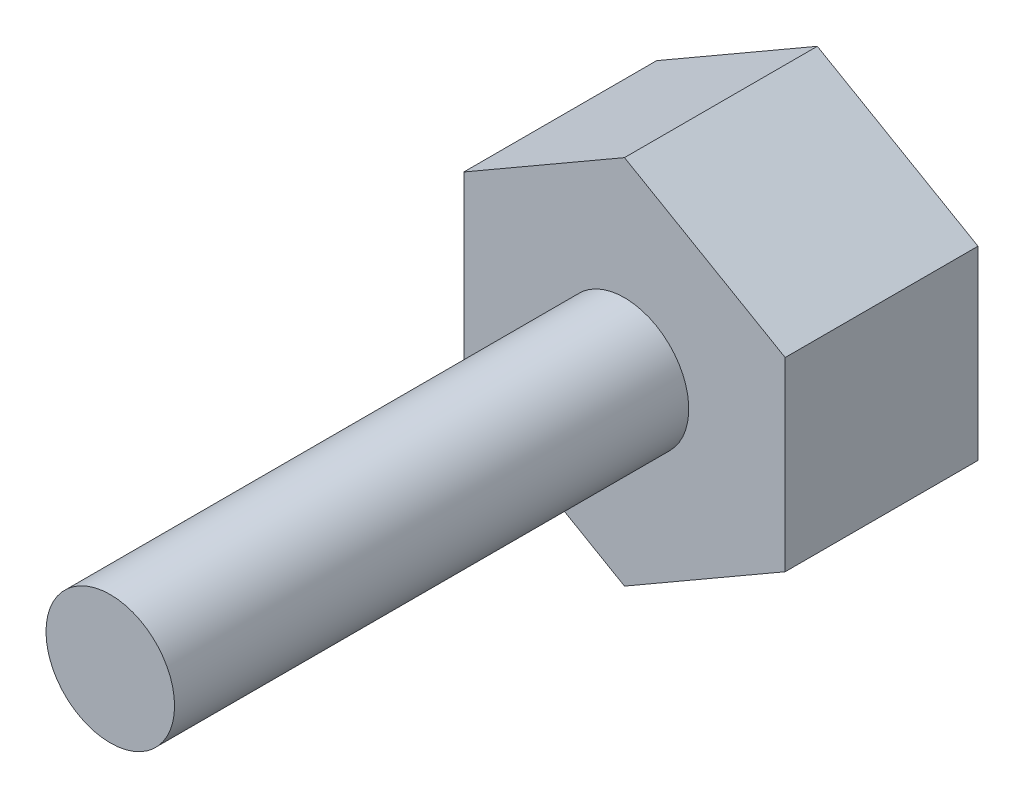
ISO-10303-21;
HEADER;
FILE_DESCRIPTION(('STEP AP214'),'2;1');
FILE_NAME('part.step','',(''),(''),'','','');
FILE_SCHEMA(('AUTOMOTIVE_DESIGN { 1 0 10303 214 1 1 1 1 }'));
ENDSEC;
DATA;
#1=APPLICATION_CONTEXT('core data for automotive mechanical design processes');
#2=APPLICATION_PROTOCOL_DEFINITION('international standard','automotive_design',2000,#1);
#3=PRODUCT_CONTEXT('',#1,'mechanical');
#4=PRODUCT('Part','Part','',(#3));
#5=PRODUCT_RELATED_PRODUCT_CATEGORY('part','',(#4));
#6=PRODUCT_DEFINITION_FORMATION('','',#4);
#7=PRODUCT_DEFINITION_CONTEXT('part definition',#1,'design');
#8=PRODUCT_DEFINITION('design','',#6,#7);
#9=PRODUCT_DEFINITION_SHAPE('','',#8);
#10=(LENGTH_UNIT() NAMED_UNIT(*) SI_UNIT(.MILLI.,.METRE.));
#11=(NAMED_UNIT(*) PLANE_ANGLE_UNIT() SI_UNIT($,.RADIAN.));
#12=(NAMED_UNIT(*) SI_UNIT($,.STERADIAN.) SOLID_ANGLE_UNIT());
#13=UNCERTAINTY_MEASURE_WITH_UNIT(LENGTH_MEASURE(1.E-05),#10,'distance_accuracy_value','');
#14=(GEOMETRIC_REPRESENTATION_CONTEXT(3) GLOBAL_UNCERTAINTY_ASSIGNED_CONTEXT((#13)) GLOBAL_UNIT_ASSIGNED_CONTEXT((#10,
#11,#12)) REPRESENTATION_CONTEXT('',''));
#15=CARTESIAN_POINT('',(0.,0.,0.));
#16=DIRECTION('',(0.,0.,1.));
#17=DIRECTION('',(1.,0.,0.));
#18=AXIS2_PLACEMENT_3D('',#15,#16,#17);
#19=CARTESIAN_POINT('',(-63.4947615904966,14.9787081339713,8.));
#20=DIRECTION('',(0.,0.,-1.));
#21=DIRECTION('',(-1.,0.,0.));
#22=AXIS2_PLACEMENT_3D('',#19,#20,#21);
#23=CYLINDRICAL_SURFACE('',#22,0.999999999999998);
#24=CARTESIAN_POINT('',(-63.4947615904966,14.9787081339713,8.));
#25=DIRECTION('',(0.,0.,1.));
#26=DIRECTION('',(1.,0.,0.));
#27=AXIS2_PLACEMENT_3D('',#24,#25,#26);
#28=CIRCLE('',#27,0.999999999999998);
#29=CARTESIAN_POINT('',(-62.4947615904966,14.9787081339713,8.));
#30=VERTEX_POINT('',#29);
#31=EDGE_CURVE('E11',#30,#30,#28,.T.);
#32=ORIENTED_EDGE('',*,*,#31,.F.);
#33=EDGE_LOOP('',(#32));
#34=FACE_BOUND('',#33,.T.);
#35=CARTESIAN_POINT('',(-63.4947615904966,14.9787081339713,0.));
#36=DIRECTION('',(0.,0.,-1.));
#37=DIRECTION('',(-1.,0.,0.));
#38=AXIS2_PLACEMENT_3D('',#35,#36,#37);
#39=CIRCLE('',#38,0.999999999999998);
#40=CARTESIAN_POINT('',(-64.4947615904966,14.9787081339713,0.));
#41=VERTEX_POINT('',#40);
#42=EDGE_CURVE('E41',#41,#41,#39,.T.);
#43=ORIENTED_EDGE('',*,*,#42,.F.);
#44=EDGE_LOOP('',(#43));
#45=FACE_BOUND('',#44,.T.);
#46=ADVANCED_FACE('F33',(#34,#45),#23,.T.);
#47=CARTESIAN_POINT('',(-63.4947615904966,14.9787081339713,8.));
#48=DIRECTION('',(0.,0.,1.));
#49=DIRECTION('',(1.,0.,0.));
#50=AXIS2_PLACEMENT_3D('',#47,#48,#49);
#51=PLANE('',#50);
#52=ORIENTED_EDGE('',*,*,#31,.T.);
#53=EDGE_LOOP('',(#52));
#54=FACE_BOUND('',#53,.T.);
#55=ADVANCED_FACE('F143',(#54),#51,.T.);
#56=CARTESIAN_POINT('',(-60.9947615904966,13.5353324609972,-3.));
#57=DIRECTION('',(-0.5,0.866025403784439,0.));
#58=DIRECTION('',(-0.866025403784439,-0.5,0.));
#59=AXIS2_PLACEMENT_3D('',#56,#57,#58);
#60=PLANE('',#59);
#61=DIRECTION('',(-0.866025403784439,-0.5,0.));
#62=VECTOR('',#61,1.);
#63=CARTESIAN_POINT('',(-60.9947615904966,13.5353324609972,0.));
#64=LINE('',#63,#62);
#65=CARTESIAN_POINT('',(-60.9947615904966,13.5353324609972,0.));
#66=VERTEX_POINT('',#65);
#67=CARTESIAN_POINT('',(-63.4947615904967,12.0919567880232,0.));
#68=VERTEX_POINT('',#67);
#69=EDGE_CURVE('E118',#66,#68,#64,.T.);
#70=ORIENTED_EDGE('',*,*,#69,.T.);
#71=DIRECTION('',(0.,0.,1.));
#72=VECTOR('',#71,1.);
#73=CARTESIAN_POINT('',(-63.4947615904967,12.0919567880232,-3.));
#74=LINE('',#73,#72);
#75=CARTESIAN_POINT('',(-63.4947615904967,12.0919567880232,-3.));
#76=VERTEX_POINT('',#75);
#77=EDGE_CURVE('E135',#76,#68,#74,.T.);
#78=ORIENTED_EDGE('',*,*,#77,.F.);
#79=DIRECTION('',(-0.866025403784439,-0.5,0.));
#80=VECTOR('',#79,1.);
#81=CARTESIAN_POINT('',(-60.9947615904966,13.5353324609972,-3.));
#82=LINE('',#81,#80);
#83=CARTESIAN_POINT('',(-60.9947615904966,13.5353324609972,-3.));
#84=VERTEX_POINT('',#83);
#85=EDGE_CURVE('E128',#84,#76,#82,.T.);
#86=ORIENTED_EDGE('',*,*,#85,.F.);
#87=DIRECTION('',(0.,0.,1.));
#88=VECTOR('',#87,1.);
#89=CARTESIAN_POINT('',(-60.9947615904966,13.5353324609972,-3.));
#90=LINE('',#89,#88);
#91=EDGE_CURVE('E114',#84,#66,#90,.T.);
#92=ORIENTED_EDGE('',*,*,#91,.T.);
#93=EDGE_LOOP('',(#70,#78,#86,#92));
#94=FACE_BOUND('',#93,.T.);
#95=ADVANCED_FACE('F148',(#94),#60,.F.);
#96=CARTESIAN_POINT('',(-63.4947615904967,12.0919567880232,-3.));
#97=DIRECTION('',(0.5,0.866025403784438,0.));
#98=DIRECTION('',(-0.866025403784438,0.5,0.));
#99=AXIS2_PLACEMENT_3D('',#96,#97,#98);
#100=PLANE('',#99);
#101=DIRECTION('',(-0.866025403784438,0.5,0.));
#102=VECTOR('',#101,1.);
#103=CARTESIAN_POINT('',(-63.4947615904967,12.0919567880232,0.));
#104=LINE('',#103,#102);
#105=CARTESIAN_POINT('',(-65.9947615904966,13.5353324609972,0.));
#106=VERTEX_POINT('',#105);
#107=EDGE_CURVE('E121',#68,#106,#104,.T.);
#108=ORIENTED_EDGE('',*,*,#107,.T.);
#109=DIRECTION('',(0.,0.,1.));
#110=VECTOR('',#109,1.);
#111=CARTESIAN_POINT('',(-65.9947615904966,13.5353324609972,-3.));
#112=LINE('',#111,#110);
#113=CARTESIAN_POINT('',(-65.9947615904966,13.5353324609972,-3.));
#114=VERTEX_POINT('',#113);
#115=EDGE_CURVE('E132',#114,#106,#112,.T.);
#116=ORIENTED_EDGE('',*,*,#115,.F.);
#117=DIRECTION('',(-0.866025403784438,0.5,0.));
#118=VECTOR('',#117,1.);
#119=CARTESIAN_POINT('',(-63.4947615904967,12.0919567880232,-3.));
#120=LINE('',#119,#118);
#121=EDGE_CURVE('E87',#76,#114,#120,.T.);
#122=ORIENTED_EDGE('',*,*,#121,.F.);
#123=ORIENTED_EDGE('',*,*,#77,.T.);
#124=EDGE_LOOP('',(#108,#116,#122,#123));
#125=FACE_BOUND('',#124,.T.);
#126=ADVANCED_FACE('F154',(#125),#100,.F.);
#127=CARTESIAN_POINT('',(-65.9947615904966,13.5353324609972,-3.));
#128=DIRECTION('',(1.,0.,0.));
#129=DIRECTION('',(0.,0.,-1.));
#130=AXIS2_PLACEMENT_3D('',#127,#128,#129);
#131=PLANE('',#130);
#132=DIRECTION('',(0.,1.,0.));
#133=VECTOR('',#132,1.);
#134=CARTESIAN_POINT('',(-65.9947615904966,13.5353324609972,0.));
#135=LINE('',#134,#133);
#136=CARTESIAN_POINT('',(-65.9947615904966,16.4220838069454,0.));
#137=VERTEX_POINT('',#136);
#138=EDGE_CURVE('E123',#106,#137,#135,.T.);
#139=ORIENTED_EDGE('',*,*,#138,.T.);
#140=DIRECTION('',(0.,0.,1.));
#141=VECTOR('',#140,1.);
#142=CARTESIAN_POINT('',(-65.9947615904966,16.4220838069454,-3.));
#143=LINE('',#142,#141);
#144=CARTESIAN_POINT('',(-65.9947615904966,16.4220838069454,-3.));
#145=VERTEX_POINT('',#144);
#146=EDGE_CURVE('E109',#145,#137,#143,.T.);
#147=ORIENTED_EDGE('',*,*,#146,.F.);
#148=DIRECTION('',(0.,1.,0.));
#149=VECTOR('',#148,1.);
#150=CARTESIAN_POINT('',(-65.9947615904966,13.5353324609972,-3.));
#151=LINE('',#150,#149);
#152=EDGE_CURVE('E100',#114,#145,#151,.T.);
#153=ORIENTED_EDGE('',*,*,#152,.F.);
#154=ORIENTED_EDGE('',*,*,#115,.T.);
#155=EDGE_LOOP('',(#139,#147,#153,#154));
#156=FACE_BOUND('',#155,.T.);
#157=ADVANCED_FACE('F160',(#156),#131,.F.);
#158=CARTESIAN_POINT('',(-65.9947615904966,16.4220838069454,-3.));
#159=DIRECTION('',(0.499999999999999,-0.866025403784439,0.));
#160=DIRECTION('',(0.866025403784439,0.499999999999999,0.));
#161=AXIS2_PLACEMENT_3D('',#158,#159,#160);
#162=PLANE('',#161);
#163=DIRECTION('',(0.866025403784439,0.499999999999999,0.));
#164=VECTOR('',#163,1.);
#165=CARTESIAN_POINT('',(-65.9947615904966,16.4220838069454,0.));
#166=LINE('',#165,#164);
#167=CARTESIAN_POINT('',(-63.4947615904966,17.8654594799194,0.));
#168=VERTEX_POINT('',#167);
#169=EDGE_CURVE('E108',#137,#168,#166,.T.);
#170=ORIENTED_EDGE('',*,*,#169,.T.);
#171=DIRECTION('',(0.,0.,1.));
#172=VECTOR('',#171,1.);
#173=CARTESIAN_POINT('',(-63.4947615904966,17.8654594799194,-3.));
#174=LINE('',#173,#172);
#175=CARTESIAN_POINT('',(-63.4947615904966,17.8654594799194,-3.));
#176=VERTEX_POINT('',#175);
#177=EDGE_CURVE('E105',#176,#168,#174,.T.);
#178=ORIENTED_EDGE('',*,*,#177,.F.);
#179=DIRECTION('',(0.866025403784439,0.499999999999999,0.));
#180=VECTOR('',#179,1.);
#181=CARTESIAN_POINT('',(-65.9947615904966,16.4220838069454,-3.));
#182=LINE('',#181,#180);
#183=EDGE_CURVE('E94',#145,#176,#182,.T.);
#184=ORIENTED_EDGE('',*,*,#183,.F.);
#185=ORIENTED_EDGE('',*,*,#146,.T.);
#186=EDGE_LOOP('',(#170,#178,#184,#185));
#187=FACE_BOUND('',#186,.T.);
#188=ADVANCED_FACE('F106',(#187),#162,.F.);
#189=CARTESIAN_POINT('',(-63.4947615904966,17.8654594799194,-3.));
#190=DIRECTION('',(-0.500000000000001,-0.866025403784438,0.));
#191=DIRECTION('',(0.866025403784438,-0.500000000000001,0.));
#192=AXIS2_PLACEMENT_3D('',#189,#190,#191);
#193=PLANE('',#192);
#194=DIRECTION('',(0.866025403784438,-0.500000000000001,0.));
#195=VECTOR('',#194,1.);
#196=CARTESIAN_POINT('',(-63.4947615904966,17.8654594799194,0.));
#197=LINE('',#196,#195);
#198=CARTESIAN_POINT('',(-60.9947615904966,16.4220838069454,0.));
#199=VERTEX_POINT('',#198);
#200=EDGE_CURVE('E72',#168,#199,#197,.T.);
#201=ORIENTED_EDGE('',*,*,#200,.T.);
#202=DIRECTION('',(0.,0.,1.));
#203=VECTOR('',#202,1.);
#204=CARTESIAN_POINT('',(-60.9947615904966,16.4220838069454,-3.));
#205=LINE('',#204,#203);
#206=CARTESIAN_POINT('',(-60.9947615904966,16.4220838069454,-3.));
#207=VERTEX_POINT('',#206);
#208=EDGE_CURVE('E110',#207,#199,#205,.T.);
#209=ORIENTED_EDGE('',*,*,#208,.F.);
#210=DIRECTION('',(0.866025403784438,-0.500000000000001,0.));
#211=VECTOR('',#210,1.);
#212=CARTESIAN_POINT('',(-63.4947615904966,17.8654594799194,-3.));
#213=LINE('',#212,#211);
#214=EDGE_CURVE('E98',#176,#207,#213,.T.);
#215=ORIENTED_EDGE('',*,*,#214,.F.);
#216=ORIENTED_EDGE('',*,*,#177,.T.);
#217=EDGE_LOOP('',(#201,#209,#215,#216));
#218=FACE_BOUND('',#217,.T.);
#219=ADVANCED_FACE('F112',(#218),#193,.F.);
#220=CARTESIAN_POINT('',(-60.9947615904966,16.4220838069454,-3.));
#221=DIRECTION('',(-1.,0.,0.));
#222=DIRECTION('',(0.,0.,1.));
#223=AXIS2_PLACEMENT_3D('',#220,#221,#222);
#224=PLANE('',#223);
#225=DIRECTION('',(0.,-1.,0.));
#226=VECTOR('',#225,1.);
#227=CARTESIAN_POINT('',(-60.9947615904966,16.4220838069454,0.));
#228=LINE('',#227,#226);
#229=EDGE_CURVE('E78',#199,#66,#228,.T.);
#230=ORIENTED_EDGE('',*,*,#229,.T.);
#231=ORIENTED_EDGE('',*,*,#91,.F.);
#232=DIRECTION('',(0.,-1.,0.));
#233=VECTOR('',#232,1.);
#234=CARTESIAN_POINT('',(-60.9947615904966,16.4220838069454,-3.));
#235=LINE('',#234,#233);
#236=EDGE_CURVE('E49',#207,#84,#235,.T.);
#237=ORIENTED_EDGE('',*,*,#236,.F.);
#238=ORIENTED_EDGE('',*,*,#208,.T.);
#239=EDGE_LOOP('',(#230,#231,#237,#238));
#240=FACE_BOUND('',#239,.T.);
#241=ADVANCED_FACE('F168',(#240),#224,.F.);
#242=CARTESIAN_POINT('',(0.,0.,-3.));
#243=DIRECTION('',(0.,0.,-1.));
#244=DIRECTION('',(-1.,0.,0.));
#245=AXIS2_PLACEMENT_3D('',#242,#243,#244);
#246=PLANE('',#245);
#247=ORIENTED_EDGE('',*,*,#85,.T.);
#248=ORIENTED_EDGE('',*,*,#121,.T.);
#249=ORIENTED_EDGE('',*,*,#152,.T.);
#250=ORIENTED_EDGE('',*,*,#183,.T.);
#251=ORIENTED_EDGE('',*,*,#214,.T.);
#252=ORIENTED_EDGE('',*,*,#236,.T.);
#253=EDGE_LOOP('',(#247,#248,#249,#250,#251,#252));
#254=FACE_BOUND('',#253,.T.);
#255=ADVANCED_FACE('F96',(#254),#246,.T.);
#256=CARTESIAN_POINT('',(0.,0.,0.));
#257=DIRECTION('',(0.,0.,-1.));
#258=DIRECTION('',(-1.,0.,0.));
#259=AXIS2_PLACEMENT_3D('',#256,#257,#258);
#260=PLANE('',#259);
#261=ORIENTED_EDGE('',*,*,#42,.T.);
#262=EDGE_LOOP('',(#261));
#263=FACE_BOUND('',#262,.T.);
#264=ORIENTED_EDGE('',*,*,#69,.F.);
#265=ORIENTED_EDGE('',*,*,#229,.F.);
#266=ORIENTED_EDGE('',*,*,#200,.F.);
#267=ORIENTED_EDGE('',*,*,#169,.F.);
#268=ORIENTED_EDGE('',*,*,#138,.F.);
#269=ORIENTED_EDGE('',*,*,#107,.F.);
#270=EDGE_LOOP('',(#264,#265,#266,#267,#268,#269));
#271=FACE_BOUND('',#270,.T.);
#272=ADVANCED_FACE('F139',(#263,#271),#260,.F.);
#273=CLOSED_SHELL('',(#46,#55,#95,#126,#157,#188,#219,#241,#255,#272));
#274=MANIFOLD_SOLID_BREP('B2',#273);
#275=ADVANCED_BREP_SHAPE_REPRESENTATION('',(#18,#274),#14);
#276=SHAPE_DEFINITION_REPRESENTATION(#9,#275);
ENDSEC;
END-ISO-10303-21;
